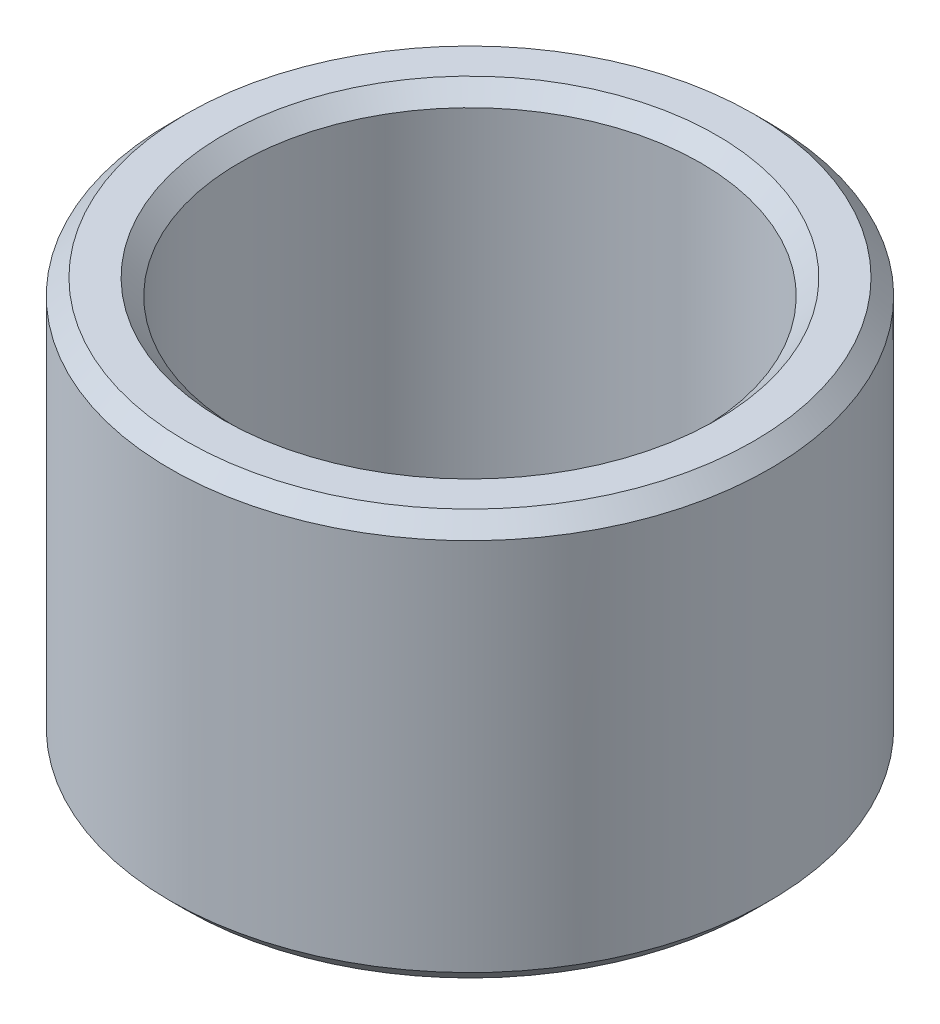
ISO-10303-21;
HEADER;
FILE_DESCRIPTION(('STEP AP214'),'2;1');
FILE_NAME('part.step','',(''),(''),'','','');
FILE_SCHEMA(('AUTOMOTIVE_DESIGN { 1 0 10303 214 1 1 1 1 }'));
ENDSEC;
DATA;
#1=APPLICATION_CONTEXT('core data for automotive mechanical design processes');
#2=APPLICATION_PROTOCOL_DEFINITION('international standard','automotive_design',2000,#1);
#3=PRODUCT_CONTEXT('',#1,'mechanical');
#4=PRODUCT('Part','Part','',(#3));
#5=PRODUCT_RELATED_PRODUCT_CATEGORY('part','',(#4));
#6=PRODUCT_DEFINITION_FORMATION('','',#4);
#7=PRODUCT_DEFINITION_CONTEXT('part definition',#1,'design');
#8=PRODUCT_DEFINITION('design','',#6,#7);
#9=PRODUCT_DEFINITION_SHAPE('','',#8);
#10=(LENGTH_UNIT() NAMED_UNIT(*) SI_UNIT(.MILLI.,.METRE.));
#11=(NAMED_UNIT(*) PLANE_ANGLE_UNIT() SI_UNIT($,.RADIAN.));
#12=(NAMED_UNIT(*) SI_UNIT($,.STERADIAN.) SOLID_ANGLE_UNIT());
#13=UNCERTAINTY_MEASURE_WITH_UNIT(LENGTH_MEASURE(1.E-05),#10,'distance_accuracy_value','');
#14=(GEOMETRIC_REPRESENTATION_CONTEXT(3) GLOBAL_UNCERTAINTY_ASSIGNED_CONTEXT((#13)) GLOBAL_UNIT_ASSIGNED_CONTEXT((#10,
#11,#12)) REPRESENTATION_CONTEXT('',''));
#15=CARTESIAN_POINT('',(0.,0.,0.));
#16=DIRECTION('',(0.,0.,1.));
#17=DIRECTION('',(1.,0.,0.));
#18=AXIS2_PLACEMENT_3D('',#15,#16,#17);
#19=CARTESIAN_POINT('',(0.,47.4337110589249,0.));
#20=DIRECTION('',(0.,-1.,0.));
#21=DIRECTION('',(0.,0.,-1.));
#22=AXIS2_PLACEMENT_3D('',#19,#20,#21);
#23=CYLINDRICAL_SURFACE('',#22,35.);
#24=CARTESIAN_POINT('',(0.,1.87150903120411,0.));
#25=DIRECTION('',(0.,1.,0.));
#26=DIRECTION('',(0.,0.,1.));
#27=AXIS2_PLACEMENT_3D('',#24,#25,#26);
#28=CIRCLE('',#27,35.);
#29=CARTESIAN_POINT('',(0.,1.87150903120411,-35.));
#30=VERTEX_POINT('',#29);
#31=EDGE_CURVE('E10',#30,#30,#28,.T.);
#32=CARTESIAN_POINT('',(0.,45.5622020277209,0.));
#33=DIRECTION('',(0.,1.,0.));
#34=DIRECTION('',(0.,0.,1.));
#35=AXIS2_PLACEMENT_3D('',#32,#33,#34);
#36=CIRCLE('',#35,35.);
#37=CARTESIAN_POINT('',(0.,45.5622020277209,-35.));
#38=VERTEX_POINT('',#37);
#39=EDGE_CURVE('E50',#38,#38,#36,.F.);
#40=CARTESIAN_POINT('',(0.,1.87150903120411,-35.));
#41=CARTESIAN_POINT('',(0.,2.32662041658449,-35.));
#42=CARTESIAN_POINT('',(0.,2.78173180196488,-35.));
#43=CARTESIAN_POINT('',(0.,3.69195457272564,-35.));
#44=CARTESIAN_POINT('',(0.,4.14706595810603,-35.));
#45=CARTESIAN_POINT('',(0.,5.0572887288668,-35.));
#46=CARTESIAN_POINT('',(0.,5.51240011424718,-35.));
#47=CARTESIAN_POINT('',(0.,6.42262288500794,-35.));
#48=CARTESIAN_POINT('',(0.,6.87773427038833,-35.));
#49=CARTESIAN_POINT('',(0.,7.78795704114909,-35.));
#50=CARTESIAN_POINT('',(0.,8.24306842652948,-35.));
#51=CARTESIAN_POINT('',(0.,9.15329119729024,-35.));
#52=CARTESIAN_POINT('',(0.,9.60840258267063,-35.));
#53=CARTESIAN_POINT('',(0.,10.5186253534314,-35.));
#54=CARTESIAN_POINT('',(0.,10.9737367388118,-35.));
#55=CARTESIAN_POINT('',(0.,11.8839595095725,-35.));
#56=CARTESIAN_POINT('',(0.,12.3390708949529,-35.));
#57=CARTESIAN_POINT('',(0.,13.2492936657137,-35.));
#58=CARTESIAN_POINT('',(0.,13.7044050510941,-35.));
#59=CARTESIAN_POINT('',(0.,14.6146278218548,-35.));
#60=CARTESIAN_POINT('',(0.,15.0697392072352,-35.));
#61=CARTESIAN_POINT('',(0.,15.979961977996,-35.));
#62=CARTESIAN_POINT('',(0.,16.4350733633764,-35.));
#63=CARTESIAN_POINT('',(0.,17.3452961341371,-35.));
#64=CARTESIAN_POINT('',(0.,17.8004075195175,-35.));
#65=CARTESIAN_POINT('',(0.,18.7106302902783,-35.));
#66=CARTESIAN_POINT('',(0.,19.1657416756587,-35.));
#67=CARTESIAN_POINT('',(0.,20.0759644464194,-35.));
#68=CARTESIAN_POINT('',(0.,20.5310758317998,-35.));
#69=CARTESIAN_POINT('',(0.,21.4412986025606,-35.));
#70=CARTESIAN_POINT('',(0.,21.896409987941,-35.));
#71=CARTESIAN_POINT('',(0.,22.8066327587017,-35.));
#72=CARTESIAN_POINT('',(0.,23.2617441440821,-35.));
#73=CARTESIAN_POINT('',(0.,24.1719669148429,-35.));
#74=CARTESIAN_POINT('',(0.,24.6270783002233,-35.));
#75=CARTESIAN_POINT('',(0.,25.537301070984,-35.));
#76=CARTESIAN_POINT('',(0.,25.9924124563644,-35.));
#77=CARTESIAN_POINT('',(0.,26.9026352271252,-35.));
#78=CARTESIAN_POINT('',(0.,27.3577466125056,-35.));
#79=CARTESIAN_POINT('',(0.,28.2679693832663,-35.));
#80=CARTESIAN_POINT('',(0.,28.7230807686467,-35.));
#81=CARTESIAN_POINT('',(0.,29.6333035394075,-35.));
#82=CARTESIAN_POINT('',(0.,30.0884149247879,-35.));
#83=CARTESIAN_POINT('',(0.,30.9986376955486,-35.));
#84=CARTESIAN_POINT('',(0.,31.453749080929,-35.));
#85=CARTESIAN_POINT('',(0.,32.3639718516898,-35.));
#86=CARTESIAN_POINT('',(0.,32.8190832370702,-35.));
#87=CARTESIAN_POINT('',(0.,33.7293060078309,-35.));
#88=CARTESIAN_POINT('',(0.,34.1844173932113,-35.));
#89=CARTESIAN_POINT('',(0.,35.0946401639721,-35.));
#90=CARTESIAN_POINT('',(0.,35.5497515493525,-35.));
#91=CARTESIAN_POINT('',(0.,36.4599743201132,-35.));
#92=CARTESIAN_POINT('',(0.,36.9150857054936,-35.));
#93=CARTESIAN_POINT('',(0.,37.8253084762544,-35.));
#94=CARTESIAN_POINT('',(0.,38.2804198616348,-35.));
#95=CARTESIAN_POINT('',(0.,39.1906426323955,-35.));
#96=CARTESIAN_POINT('',(0.,39.6457540177759,-35.));
#97=CARTESIAN_POINT('',(0.,40.5559767885367,-35.));
#98=CARTESIAN_POINT('',(0.,41.0110881739171,-35.));
#99=CARTESIAN_POINT('',(0.,41.9213109446778,-35.));
#100=CARTESIAN_POINT('',(0.,42.3764223300582,-35.));
#101=CARTESIAN_POINT('',(0.,43.286645100819,-35.));
#102=CARTESIAN_POINT('',(0.,43.7417564861994,-35.));
#103=CARTESIAN_POINT('',(0.,44.6519792569601,-35.));
#104=CARTESIAN_POINT('',(0.,45.1070906423405,-35.));
#105=CARTESIAN_POINT('',(0.,45.5622020277209,-35.));
#106=B_SPLINE_CURVE_WITH_KNOTS('',3,(#40,#41,#42,#43,#44,#45,#46,#47,#48,#49,#50,#51,#52,#53,
#54,#55,#56,#57,#58,#59,#60,#61,#62,#63,#64,#65,#66,#67,#68,#69,#70,#71,#72,#73,#74,#75,#76,#77,
#78,#79,#80,#81,#82,#83,#84,#85,#86,#87,#88,#89,#90,#91,#92,#93,#94,#95,#96,#97,#98,#99,#100,
#101,#102,#103,#104,#105),.UNSPECIFIED.,.F.,.F.,(4,2,2,2,2,2,2,2,2,2,2,2,2,2,2,2,2,2,2,2,2,2,2,
2,2,2,2,2,2,2,2,2,4),(0.,1.36533415614115,2.7306683122823,4.09600246842345,5.4613366245646,
6.82667078070575,8.1920049368469,9.55733909298805,10.9226732491292,12.2880074052703,
13.6533415614115,15.0186757175526,16.3840098736938,17.749344029835,19.1146781859761,
20.4800123421172,21.8453464982584,23.2106806543996,24.5760148105407,25.9413489666819,
27.306683122823,28.6720172789642,30.0373514351053,31.4026855912464,32.7680197473876,
34.1333539035288,35.4986880596699,36.8640222158111,38.2293563719522,39.5946905280934,
40.9600246842345,42.3253588403756,43.6906929965168),.UNSPECIFIED.);
#107=EDGE_CURVE('BSEAM39',#30,#38,#106,.T.);
#108=ORIENTED_EDGE('',*,*,#31,.T.);
#109=ORIENTED_EDGE('',*,*,#39,.T.);
#110=ORIENTED_EDGE('',*,*,#107,.T.);
#111=ORIENTED_EDGE('',*,*,#107,.F.);
#112=EDGE_LOOP('',(#108,#110,#109,#111));
#113=FACE_BOUND('',#112,.T.);
#114=ADVANCED_FACE('F39',(#113),#23,.T.);
#115=CARTESIAN_POINT('',(0.,47.4337110589249,0.));
#116=DIRECTION('',(0.,1.,0.));
#117=DIRECTION('',(0.,0.,1.));
#118=AXIS2_PLACEMENT_3D('',#115,#116,#117);
#119=PLANE('',#118);
#120=CARTESIAN_POINT('',(0.,47.4337110589249,0.));
#121=DIRECTION('',(0.,1.,0.));
#122=DIRECTION('',(0.,0.,1.));
#123=AXIS2_PLACEMENT_3D('',#120,#121,#122);
#124=CIRCLE('',#123,28.8206059016066);
#125=CARTESIAN_POINT('',(0.,47.4337110589249,28.8206059016066));
#126=VERTEX_POINT('',#125);
#127=EDGE_CURVE('E58',#126,#126,#124,.F.);
#128=ORIENTED_EDGE('',*,*,#127,.T.);
#129=EDGE_LOOP('',(#128));
#130=FACE_BOUND('',#129,.T.);
#131=CARTESIAN_POINT('',(0.,47.4337110589249,0.));
#132=DIRECTION('',(0.,1.,0.));
#133=DIRECTION('',(0.,0.,1.));
#134=AXIS2_PLACEMENT_3D('',#131,#132,#133);
#135=CIRCLE('',#134,33.128490968796);
#136=CARTESIAN_POINT('',(0.,47.4337110589249,33.128490968796));
#137=VERTEX_POINT('',#136);
#138=EDGE_CURVE('E61',#137,#137,#135,.T.);
#139=ORIENTED_EDGE('',*,*,#138,.T.);
#140=EDGE_LOOP('',(#139));
#141=FACE_BOUND('',#140,.T.);
#142=ADVANCED_FACE('F88',(#130,#141),#119,.T.);
#143=CARTESIAN_POINT('',(0.,0.,0.));
#144=DIRECTION('',(0.,1.,0.));
#145=DIRECTION('',(0.,0.,1.));
#146=AXIS2_PLACEMENT_3D('',#143,#144,#145);
#147=PLANE('',#146);
#148=CARTESIAN_POINT('',(0.,0.,0.));
#149=DIRECTION('',(0.,1.,0.));
#150=DIRECTION('',(0.,0.,1.));
#151=AXIS2_PLACEMENT_3D('',#148,#149,#150);
#152=CIRCLE('',#151,28.8206059016065);
#153=CARTESIAN_POINT('',(0.,0.,28.8206059016065));
#154=VERTEX_POINT('',#153);
#155=EDGE_CURVE('E51',#154,#154,#152,.T.);
#156=ORIENTED_EDGE('',*,*,#155,.T.);
#157=EDGE_LOOP('',(#156));
#158=FACE_BOUND('',#157,.T.);
#159=CARTESIAN_POINT('',(0.,0.,0.));
#160=DIRECTION('',(0.,1.,0.));
#161=DIRECTION('',(0.,0.,1.));
#162=AXIS2_PLACEMENT_3D('',#159,#160,#161);
#163=CIRCLE('',#162,33.1284909687959);
#164=CARTESIAN_POINT('',(0.,0.,33.1284909687959));
#165=VERTEX_POINT('',#164);
#166=EDGE_CURVE('E54',#165,#165,#163,.F.);
#167=ORIENTED_EDGE('',*,*,#166,.T.);
#168=EDGE_LOOP('',(#167));
#169=FACE_BOUND('',#168,.T.);
#170=ADVANCED_FACE('F83',(#158,#169),#147,.F.);
#171=CARTESIAN_POINT('',(0.,47.4337110589249,0.));
#172=DIRECTION('',(0.,-1.,0.));
#173=DIRECTION('',(0.,0.,-1.));
#174=AXIS2_PLACEMENT_3D('',#171,#172,#173);
#175=CYLINDRICAL_SURFACE('',#174,26.9490968704025);
#176=CARTESIAN_POINT('',(0.,45.5622020277209,0.));
#177=DIRECTION('',(0.,1.,0.));
#178=DIRECTION('',(0.,0.,1.));
#179=AXIS2_PLACEMENT_3D('',#176,#177,#178);
#180=CIRCLE('',#179,26.9490968704025);
#181=CARTESIAN_POINT('',(0.,45.5622020277209,-26.9490968704025));
#182=VERTEX_POINT('',#181);
#183=EDGE_CURVE('E67',#182,#182,#180,.T.);
#184=CARTESIAN_POINT('',(0.,1.87150903120403,0.));
#185=DIRECTION('',(0.,1.,0.));
#186=DIRECTION('',(0.,0.,1.));
#187=AXIS2_PLACEMENT_3D('',#184,#185,#186);
#188=CIRCLE('',#187,26.9490968704025);
#189=CARTESIAN_POINT('',(0.,1.87150903120403,-26.9490968704025));
#190=VERTEX_POINT('',#189);
#191=EDGE_CURVE('E69',#190,#190,#188,.F.);
#192=CARTESIAN_POINT('',(0.,45.5622020277209,-26.9490968704025));
#193=CARTESIAN_POINT('',(0.,45.1070906423405,-26.9490968704025));
#194=CARTESIAN_POINT('',(0.,44.6519792569601,-26.9490968704025));
#195=CARTESIAN_POINT('',(0.,43.7417564861993,-26.9490968704025));
#196=CARTESIAN_POINT('',(0.,43.2866451008189,-26.9490968704025));
#197=CARTESIAN_POINT('',(0.,42.3764223300582,-26.9490968704025));
#198=CARTESIAN_POINT('',(0.,41.9213109446778,-26.9490968704025));
#199=CARTESIAN_POINT('',(0.,41.011088173917,-26.9490968704025));
#200=CARTESIAN_POINT('',(0.,40.5559767885366,-26.9490968704025));
#201=CARTESIAN_POINT('',(0.,39.6457540177759,-26.9490968704025));
#202=CARTESIAN_POINT('',(0.,39.1906426323955,-26.9490968704025));
#203=CARTESIAN_POINT('',(0.,38.2804198616347,-26.9490968704025));
#204=CARTESIAN_POINT('',(0.,37.8253084762543,-26.9490968704025));
#205=CARTESIAN_POINT('',(0.,36.9150857054936,-26.9490968704025));
#206=CARTESIAN_POINT('',(0.,36.4599743201132,-26.9490968704025));
#207=CARTESIAN_POINT('',(0.,35.5497515493524,-26.9490968704025));
#208=CARTESIAN_POINT('',(0.,35.094640163972,-26.9490968704025));
#209=CARTESIAN_POINT('',(0.,34.1844173932113,-26.9490968704025));
#210=CARTESIAN_POINT('',(0.,33.7293060078309,-26.9490968704025));
#211=CARTESIAN_POINT('',(0.,32.8190832370701,-26.9490968704025));
#212=CARTESIAN_POINT('',(0.,32.3639718516897,-26.9490968704025));
#213=CARTESIAN_POINT('',(0.,31.453749080929,-26.9490968704025));
#214=CARTESIAN_POINT('',(0.,30.9986376955486,-26.9490968704025));
#215=CARTESIAN_POINT('',(0.,30.0884149247878,-26.9490968704025));
#216=CARTESIAN_POINT('',(0.,29.6333035394074,-26.9490968704025));
#217=CARTESIAN_POINT('',(0.,28.7230807686467,-26.9490968704025));
#218=CARTESIAN_POINT('',(0.,28.2679693832663,-26.9490968704025));
#219=CARTESIAN_POINT('',(0.,27.3577466125055,-26.9490968704025));
#220=CARTESIAN_POINT('',(0.,26.9026352271251,-26.9490968704025));
#221=CARTESIAN_POINT('',(0.,25.9924124563644,-26.9490968704025));
#222=CARTESIAN_POINT('',(0.,25.537301070984,-26.9490968704025));
#223=CARTESIAN_POINT('',(0.,24.6270783002232,-26.9490968704025));
#224=CARTESIAN_POINT('',(0.,24.1719669148428,-26.9490968704025));
#225=CARTESIAN_POINT('',(0.,23.2617441440821,-26.9490968704025));
#226=CARTESIAN_POINT('',(0.,22.8066327587017,-26.9490968704025));
#227=CARTESIAN_POINT('',(0.,21.8964099879409,-26.9490968704025));
#228=CARTESIAN_POINT('',(0.,21.4412986025605,-26.9490968704025));
#229=CARTESIAN_POINT('',(0.,20.5310758317998,-26.9490968704025));
#230=CARTESIAN_POINT('',(0.,20.0759644464194,-26.9490968704025));
#231=CARTESIAN_POINT('',(0.,19.1657416756586,-26.9490968704025));
#232=CARTESIAN_POINT('',(0.,18.7106302902782,-26.9490968704025));
#233=CARTESIAN_POINT('',(0.,17.8004075195175,-26.9490968704025));
#234=CARTESIAN_POINT('',(0.,17.3452961341371,-26.9490968704025));
#235=CARTESIAN_POINT('',(0.,16.4350733633763,-26.9490968704025));
#236=CARTESIAN_POINT('',(0.,15.9799619779959,-26.9490968704025));
#237=CARTESIAN_POINT('',(0.,15.0697392072352,-26.9490968704025));
#238=CARTESIAN_POINT('',(0.,14.6146278218548,-26.9490968704025));
#239=CARTESIAN_POINT('',(0.,13.704405051094,-26.9490968704025));
#240=CARTESIAN_POINT('',(0.,13.2492936657136,-26.9490968704025));
#241=CARTESIAN_POINT('',(0.,12.3390708949529,-26.9490968704025));
#242=CARTESIAN_POINT('',(0.,11.8839595095725,-26.9490968704025));
#243=CARTESIAN_POINT('',(0.,10.9737367388117,-26.9490968704025));
#244=CARTESIAN_POINT('',(0.,10.5186253534313,-26.9490968704025));
#245=CARTESIAN_POINT('',(0.,9.60840258267055,-26.9490968704025));
#246=CARTESIAN_POINT('',(0.,9.15329119729017,-26.9490968704025));
#247=CARTESIAN_POINT('',(0.,8.2430684265294,-26.9490968704025));
#248=CARTESIAN_POINT('',(0.,7.78795704114902,-26.9490968704025));
#249=CARTESIAN_POINT('',(0.,6.87773427038825,-26.9490968704025));
#250=CARTESIAN_POINT('',(0.,6.42262288500786,-26.9490968704025));
#251=CARTESIAN_POINT('',(0.,5.5124001142471,-26.9490968704025));
#252=CARTESIAN_POINT('',(0.,5.05728872886671,-26.9490968704025));
#253=CARTESIAN_POINT('',(0.,4.14706595810594,-26.9490968704025));
#254=CARTESIAN_POINT('',(0.,3.69195457272556,-26.9490968704025));
#255=CARTESIAN_POINT('',(0.,2.78173180196479,-26.9490968704025));
#256=CARTESIAN_POINT('',(0.,2.32662041658441,-26.9490968704025));
#257=CARTESIAN_POINT('',(0.,1.87150903120403,-26.9490968704025));
#258=B_SPLINE_CURVE_WITH_KNOTS('',3,(#192,#193,#194,#195,#196,#197,#198,#199,#200,#201,#202,
#203,#204,#205,#206,#207,#208,#209,#210,#211,#212,#213,#214,#215,#216,#217,#218,#219,#220,#221,
#222,#223,#224,#225,#226,#227,#228,#229,#230,#231,#232,#233,#234,#235,#236,#237,#238,#239,#240,
#241,#242,#243,#244,#245,#246,#247,#248,#249,#250,#251,#252,#253,#254,#255,#256,#257),
.UNSPECIFIED.,.F.,.F.,(4,2,2,2,2,2,2,2,2,2,2,2,2,2,2,2,2,2,2,2,2,2,2,2,2,2,2,2,2,2,2,2,4),(0.,
1.36533415614114,2.7306683122823,4.09600246842345,5.4613366245646,6.82667078070575,
8.1920049368469,9.55733909298805,10.9226732491292,12.2880074052704,13.6533415614115,
15.0186757175527,16.3840098736938,17.749344029835,19.1146781859761,20.4800123421173,
21.8453464982584,23.2106806543996,24.5760148105407,25.9413489666819,27.306683122823,
28.6720172789642,30.0373514351053,31.4026855912465,32.7680197473876,34.1333539035288,
35.4986880596699,36.8640222158111,38.2293563719522,39.5946905280934,40.9600246842345,
42.3253588403757,43.6906929965168),.UNSPECIFIED.);
#259=EDGE_CURVE('BSEAM71',#182,#190,#258,.T.);
#260=ORIENTED_EDGE('',*,*,#183,.T.);
#261=ORIENTED_EDGE('',*,*,#191,.T.);
#262=ORIENTED_EDGE('',*,*,#259,.T.);
#263=ORIENTED_EDGE('',*,*,#259,.F.);
#264=EDGE_LOOP('',(#260,#262,#261,#263));
#265=FACE_BOUND('',#264,.T.);
#266=ADVANCED_FACE('F71',(#265),#175,.F.);
#267=CARTESIAN_POINT('',(0.,45.5622020277209,0.));
#268=DIRECTION('',(0.,1.,0.));
#269=DIRECTION('',(0.,0.,1.));
#270=AXIS2_PLACEMENT_3D('',#267,#268,#269);
#271=CONICAL_SURFACE('',#270,26.9490968704025,0.785398163397453);
#272=ORIENTED_EDGE('',*,*,#127,.F.);
#273=EDGE_LOOP('',(#272));
#274=FACE_BOUND('',#273,.T.);
#275=ORIENTED_EDGE('',*,*,#183,.F.);
#276=EDGE_LOOP('',(#275));
#277=FACE_BOUND('',#276,.T.);
#278=ADVANCED_FACE('F77',(#274,#277),#271,.F.);
#279=CARTESIAN_POINT('',(0.,0.,0.));
#280=DIRECTION('',(0.,-1.,0.));
#281=DIRECTION('',(0.,0.,-1.));
#282=AXIS2_PLACEMENT_3D('',#279,#280,#281);
#283=CONICAL_SURFACE('',#282,28.8206059016065,0.785398163397446);
#284=ORIENTED_EDGE('',*,*,#191,.F.);
#285=EDGE_LOOP('',(#284));
#286=FACE_BOUND('',#285,.T.);
#287=ORIENTED_EDGE('',*,*,#155,.F.);
#288=EDGE_LOOP('',(#287));
#289=FACE_BOUND('',#288,.T.);
#290=ADVANCED_FACE('F73',(#286,#289),#283,.F.);
#291=CARTESIAN_POINT('',(0.,1.8715090312041,0.));
#292=DIRECTION('',(0.,1.,0.));
#293=DIRECTION('',(0.,0.,1.));
#294=AXIS2_PLACEMENT_3D('',#291,#292,#293);
#295=CONICAL_SURFACE('',#294,35.,0.785398163397452);
#296=ORIENTED_EDGE('',*,*,#166,.F.);
#297=EDGE_LOOP('',(#296));
#298=FACE_BOUND('',#297,.T.);
#299=ORIENTED_EDGE('',*,*,#31,.F.);
#300=EDGE_LOOP('',(#299));
#301=FACE_BOUND('',#300,.T.);
#302=ADVANCED_FACE('F76',(#298,#301),#295,.T.);
#303=CARTESIAN_POINT('',(0.,47.4337110589249,0.));
#304=DIRECTION('',(0.,-1.,0.));
#305=DIRECTION('',(0.,0.,-1.));
#306=AXIS2_PLACEMENT_3D('',#303,#304,#305);
#307=CONICAL_SURFACE('',#306,33.128490968796,0.785398163397445);
#308=ORIENTED_EDGE('',*,*,#39,.F.);
#309=EDGE_LOOP('',(#308));
#310=FACE_BOUND('',#309,.T.);
#311=ORIENTED_EDGE('',*,*,#138,.F.);
#312=EDGE_LOOP('',(#311));
#313=FACE_BOUND('',#312,.T.);
#314=ADVANCED_FACE('F45',(#310,#313),#307,.T.);
#315=CLOSED_SHELL('',(#114,#142,#170,#266,#278,#290,#302,#314));
#316=MANIFOLD_SOLID_BREP('B2',#315);
#317=ADVANCED_BREP_SHAPE_REPRESENTATION('',(#18,#316),#14);
#318=SHAPE_DEFINITION_REPRESENTATION(#9,#317);
ENDSEC;
END-ISO-10303-21;
